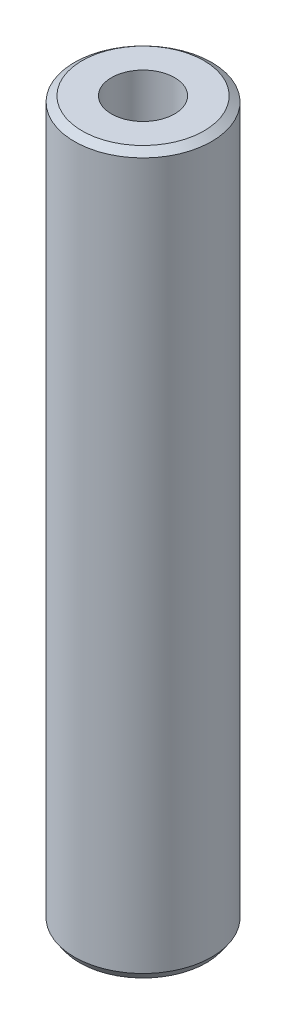
ISO-10303-21;
HEADER;
FILE_DESCRIPTION(('STEP AP214'),'2;1');
FILE_NAME('part.step','',(''),(''),'','','');
FILE_SCHEMA(('AUTOMOTIVE_DESIGN { 1 0 10303 214 1 1 1 1 }'));
ENDSEC;
DATA;
#1=APPLICATION_CONTEXT('core data for automotive mechanical design processes');
#2=APPLICATION_PROTOCOL_DEFINITION('international standard','automotive_design',2000,#1);
#3=PRODUCT_CONTEXT('',#1,'mechanical');
#4=PRODUCT('Part','Part','',(#3));
#5=PRODUCT_RELATED_PRODUCT_CATEGORY('part','',(#4));
#6=PRODUCT_DEFINITION_FORMATION('','',#4);
#7=PRODUCT_DEFINITION_CONTEXT('part definition',#1,'design');
#8=PRODUCT_DEFINITION('design','',#6,#7);
#9=PRODUCT_DEFINITION_SHAPE('','',#8);
#10=(LENGTH_UNIT() NAMED_UNIT(*) SI_UNIT(.MILLI.,.METRE.));
#11=(NAMED_UNIT(*) PLANE_ANGLE_UNIT() SI_UNIT($,.RADIAN.));
#12=(NAMED_UNIT(*) SI_UNIT($,.STERADIAN.) SOLID_ANGLE_UNIT());
#13=UNCERTAINTY_MEASURE_WITH_UNIT(LENGTH_MEASURE(1.E-05),#10,'distance_accuracy_value','');
#14=(GEOMETRIC_REPRESENTATION_CONTEXT(3) GLOBAL_UNCERTAINTY_ASSIGNED_CONTEXT((#13)) GLOBAL_UNIT_ASSIGNED_CONTEXT((#10,
#11,#12)) REPRESENTATION_CONTEXT('',''));
#15=CARTESIAN_POINT('',(0.,0.,0.));
#16=DIRECTION('',(0.,0.,1.));
#17=DIRECTION('',(1.,0.,0.));
#18=AXIS2_PLACEMENT_3D('',#15,#16,#17);
#19=CARTESIAN_POINT('',(0.,419.466632299774,0.));
#20=DIRECTION('',(0.,-1.,0.));
#21=DIRECTION('',(0.,0.,-1.));
#22=AXIS2_PLACEMENT_3D('',#19,#20,#21);
#23=CYLINDRICAL_SURFACE('',#22,40.);
#24=CARTESIAN_POINT('',(0.,416.352013566591,0.));
#25=DIRECTION('',(0.,1.,0.));
#26=DIRECTION('',(0.,0.,1.));
#27=AXIS2_PLACEMENT_3D('',#24,#25,#26);
#28=CIRCLE('',#27,40.);
#29=CARTESIAN_POINT('',(0.,416.352013566591,-40.));
#30=VERTEX_POINT('',#29);
#31=EDGE_CURVE('E50',#30,#30,#28,.F.);
#32=ORIENTED_EDGE('',*,*,#31,.T.);
#33=EDGE_LOOP('',(#32));
#34=FACE_BOUND('',#33,.T.);
#35=CARTESIAN_POINT('',(0.,4.47765466066197,0.));
#36=DIRECTION('',(0.,1.,0.));
#37=DIRECTION('',(0.,0.,1.));
#38=AXIS2_PLACEMENT_3D('',#35,#36,#37);
#39=CIRCLE('',#38,40.);
#40=CARTESIAN_POINT('',(0.,4.47765466066197,40.));
#41=VERTEX_POINT('',#40);
#42=EDGE_CURVE('E51',#41,#41,#39,.T.);
#43=ORIENTED_EDGE('',*,*,#42,.T.);
#44=EDGE_LOOP('',(#43));
#45=FACE_BOUND('',#44,.T.);
#46=ADVANCED_FACE('F39',(#34,#45),#23,.T.);
#47=CARTESIAN_POINT('',(0.,419.466632299774,0.));
#48=DIRECTION('',(0.,1.,0.));
#49=DIRECTION('',(0.,0.,1.));
#50=AXIS2_PLACEMENT_3D('',#47,#48,#49);
#51=PLANE('',#50);
#52=CARTESIAN_POINT('',(0.,419.466632299774,0.));
#53=DIRECTION('',(0.,1.,0.));
#54=DIRECTION('',(0.,0.,1.));
#55=AXIS2_PLACEMENT_3D('',#52,#53,#54);
#56=CIRCLE('',#55,35.5223453393382);
#57=CARTESIAN_POINT('',(0.,419.466632299774,-35.5223453393382));
#58=VERTEX_POINT('',#57);
#59=EDGE_CURVE('E54',#58,#58,#56,.T.);
#60=ORIENTED_EDGE('',*,*,#59,.T.);
#61=EDGE_LOOP('',(#60));
#62=FACE_BOUND('',#61,.T.);
#63=CARTESIAN_POINT('',(0.,419.466632299774,0.));
#64=DIRECTION('',(0.,1.,0.));
#65=DIRECTION('',(0.,0.,1.));
#66=AXIS2_PLACEMENT_3D('',#63,#64,#65);
#67=CIRCLE('',#66,18.3951845976825);
#68=CARTESIAN_POINT('',(0.,419.466632299774,18.3951845976825));
#69=VERTEX_POINT('',#68);
#70=EDGE_CURVE('E58',#69,#69,#67,.T.);
#71=ORIENTED_EDGE('',*,*,#70,.F.);
#72=EDGE_LOOP('',(#71));
#73=FACE_BOUND('',#72,.T.);
#74=ADVANCED_FACE('F69',(#62,#73),#51,.T.);
#75=CARTESIAN_POINT('',(0.,0.,0.));
#76=DIRECTION('',(0.,1.,0.));
#77=DIRECTION('',(0.,0.,1.));
#78=AXIS2_PLACEMENT_3D('',#75,#76,#77);
#79=PLANE('',#78);
#80=CARTESIAN_POINT('',(0.,0.,0.));
#81=DIRECTION('',(0.,1.,0.));
#82=DIRECTION('',(0.,0.,1.));
#83=AXIS2_PLACEMENT_3D('',#80,#81,#82);
#84=CIRCLE('',#83,36.8853812668172);
#85=CARTESIAN_POINT('',(0.,0.,36.8853812668172));
#86=VERTEX_POINT('',#85);
#87=EDGE_CURVE('E10',#86,#86,#84,.F.);
#88=ORIENTED_EDGE('',*,*,#87,.T.);
#89=EDGE_LOOP('',(#88));
#90=FACE_BOUND('',#89,.T.);
#91=CARTESIAN_POINT('',(0.,0.,0.));
#92=DIRECTION('',(0.,1.,0.));
#93=DIRECTION('',(0.,0.,1.));
#94=AXIS2_PLACEMENT_3D('',#91,#92,#93);
#95=CIRCLE('',#94,18.3951845976825);
#96=CARTESIAN_POINT('',(0.,0.,18.3951845976825));
#97=VERTEX_POINT('',#96);
#98=EDGE_CURVE('E63',#97,#97,#95,.T.);
#99=ORIENTED_EDGE('',*,*,#98,.T.);
#100=EDGE_LOOP('',(#99));
#101=FACE_BOUND('',#100,.T.);
#102=ADVANCED_FACE('F75',(#90,#101),#79,.F.);
#103=CARTESIAN_POINT('',(0.,419.466632299774,0.));
#104=DIRECTION('',(0.,-1.,0.));
#105=DIRECTION('',(0.,0.,-1.));
#106=AXIS2_PLACEMENT_3D('',#103,#104,#105);
#107=CYLINDRICAL_SURFACE('',#106,18.3951845976825);
#108=ORIENTED_EDGE('',*,*,#70,.T.);
#109=EDGE_LOOP('',(#108));
#110=FACE_BOUND('',#109,.T.);
#111=ORIENTED_EDGE('',*,*,#98,.F.);
#112=EDGE_LOOP('',(#111));
#113=FACE_BOUND('',#112,.T.);
#114=ADVANCED_FACE('F70',(#110,#113),#107,.F.);
#115=CARTESIAN_POINT('',(0.,419.466632299774,0.));
#116=DIRECTION('',(0.,-1.,0.));
#117=DIRECTION('',(0.,0.,-1.));
#118=AXIS2_PLACEMENT_3D('',#115,#116,#117);
#119=CONICAL_SURFACE('',#118,35.5223453393382,0.963035187304045);
#120=CARTESIAN_POINT('',(0.,416.352013566591,-40.));
#121=CARTESIAN_POINT('',(0.,416.384457511729,-39.9533577639515));
#122=CARTESIAN_POINT('',(0.,416.416901456866,-39.9067155279029));
#123=CARTESIAN_POINT('',(0.,416.481789347141,-39.8134310558058));
#124=CARTESIAN_POINT('',(0.,416.514233292278,-39.7667888197572));
#125=CARTESIAN_POINT('',(0.,416.579121182553,-39.6735043476601));
#126=CARTESIAN_POINT('',(0.,416.61156512769,-39.6268621116116));
#127=CARTESIAN_POINT('',(0.,416.676453017965,-39.5335776395144));
#128=CARTESIAN_POINT('',(0.,416.708896963102,-39.4869354034659));
#129=CARTESIAN_POINT('',(0.,416.773784853377,-39.3936509313687));
#130=CARTESIAN_POINT('',(0.,416.806228798514,-39.3470086953202));
#131=CARTESIAN_POINT('',(0.,416.871116688789,-39.2537242232231));
#132=CARTESIAN_POINT('',(0.,416.903560633926,-39.2070819871745));
#133=CARTESIAN_POINT('',(0.,416.968448524201,-39.1137975150774));
#134=CARTESIAN_POINT('',(0.,417.000892469338,-39.0671552790288));
#135=CARTESIAN_POINT('',(0.,417.065780359613,-38.9738708069317));
#136=CARTESIAN_POINT('',(0.,417.09822430475,-38.9272285708831));
#137=CARTESIAN_POINT('',(0.,417.163112195024,-38.833944098786));
#138=CARTESIAN_POINT('',(0.,417.195556140162,-38.7873018627375));
#139=CARTESIAN_POINT('',(0.,417.260444030436,-38.6940173906403));
#140=CARTESIAN_POINT('',(0.,417.292887975574,-38.6473751545918));
#141=CARTESIAN_POINT('',(0.,417.357775865848,-38.5540906824947));
#142=CARTESIAN_POINT('',(0.,417.390219810986,-38.5074484464461));
#143=CARTESIAN_POINT('',(0.,417.45510770126,-38.414163974349));
#144=CARTESIAN_POINT('',(0.,417.487551646398,-38.3675217383004));
#145=CARTESIAN_POINT('',(0.,417.552439536672,-38.2742372662033));
#146=CARTESIAN_POINT('',(0.,417.58488348181,-38.2275950301547));
#147=CARTESIAN_POINT('',(0.,417.649771372084,-38.1343105580576));
#148=CARTESIAN_POINT('',(0.,417.682215317222,-38.0876683220091));
#149=CARTESIAN_POINT('',(0.,417.747103207496,-37.9943838499119));
#150=CARTESIAN_POINT('',(0.,417.779547152634,-37.9477416138634));
#151=CARTESIAN_POINT('',(0.,417.844435042908,-37.8544571417663));
#152=CARTESIAN_POINT('',(0.,417.876878988046,-37.8078149057177));
#153=CARTESIAN_POINT('',(0.,417.94176687832,-37.7145304336206));
#154=CARTESIAN_POINT('',(0.,417.974210823457,-37.667888197572));
#155=CARTESIAN_POINT('',(0.,418.039098713732,-37.5746037254749));
#156=CARTESIAN_POINT('',(0.,418.071542658869,-37.5279614894263));
#157=CARTESIAN_POINT('',(0.,418.136430549144,-37.4346770173292));
#158=CARTESIAN_POINT('',(0.,418.168874494281,-37.3880347812806));
#159=CARTESIAN_POINT('',(0.,418.233762384556,-37.2947503091835));
#160=CARTESIAN_POINT('',(0.,418.266206329693,-37.248108073135));
#161=CARTESIAN_POINT('',(0.,418.331094219968,-37.1548236010378));
#162=CARTESIAN_POINT('',(0.,418.363538165105,-37.1081813649893));
#163=CARTESIAN_POINT('',(0.,418.42842605538,-37.0148968928922));
#164=CARTESIAN_POINT('',(0.,418.460870000517,-36.9682546568436));
#165=CARTESIAN_POINT('',(0.,418.525757890792,-36.8749701847465));
#166=CARTESIAN_POINT('',(0.,418.558201835929,-36.8283279486979));
#167=CARTESIAN_POINT('',(0.,418.623089726204,-36.7350434766008));
#168=CARTESIAN_POINT('',(0.,418.655533671341,-36.6884012405522));
#169=CARTESIAN_POINT('',(0.,418.720421561616,-36.5951167684551));
#170=CARTESIAN_POINT('',(0.,418.752865506753,-36.5484745324066));
#171=CARTESIAN_POINT('',(0.,418.817753397028,-36.4551900603094));
#172=CARTESIAN_POINT('',(0.,418.850197342165,-36.4085478242609));
#173=CARTESIAN_POINT('',(0.,418.91508523244,-36.3152633521637));
#174=CARTESIAN_POINT('',(0.,418.947529177577,-36.2686211161152));
#175=CARTESIAN_POINT('',(0.,419.012417067852,-36.1753366440181));
#176=CARTESIAN_POINT('',(0.,419.044861012989,-36.1286944079695));
#177=CARTESIAN_POINT('',(0.,419.109748903264,-36.0354099358724));
#178=CARTESIAN_POINT('',(0.,419.142192848401,-35.9887676998238));
#179=CARTESIAN_POINT('',(0.,419.207080738676,-35.8954832277267));
#180=CARTESIAN_POINT('',(0.,419.239524683813,-35.8488409916781));
#181=CARTESIAN_POINT('',(0.,419.304412574088,-35.755556519581));
#182=CARTESIAN_POINT('',(0.,419.336856519225,-35.7089142835325));
#183=CARTESIAN_POINT('',(0.,419.401744409499,-35.6156298114353));
#184=CARTESIAN_POINT('',(0.,419.434188354637,-35.5689875753868));
#185=CARTESIAN_POINT('',(0.,419.466632299774,-35.5223453393382));
#186=B_SPLINE_CURVE_WITH_KNOTS('',3,(#120,#121,#122,#123,#124,#125,#126,#127,#128,#129,#130,
#131,#132,#133,#134,#135,#136,#137,#138,#139,#140,#141,#142,#143,#144,#145,#146,#147,#148,#149,
#150,#151,#152,#153,#154,#155,#156,#157,#158,#159,#160,#161,#162,#163,#164,#165,#166,#167,#168,
#169,#170,#171,#172,#173,#174,#175,#176,#177,#178,#179,#180,#181,#182,#183,#184,#185),
.UNSPECIFIED.,.F.,.F.,(4,2,2,2,2,2,2,2,2,2,2,2,2,2,2,2,2,2,2,2,2,2,2,2,2,2,2,2,2,2,2,2,4),(0.,
0.170449317502726,0.340898635005446,0.511347952508199,0.681797270010925,0.852246587513645,
1.0226959050164,1.19314522251912,1.36359454002184,1.5340438575246,1.70449317502732,
1.87494249253004,2.04539181003279,2.21584112753552,2.38629044503824,2.55673976254099,
2.72718908004372,2.89763839754644,3.06808771504919,3.23853703255192,3.40898635005464,
3.57943566755739,3.74988498506011,3.92033430256284,4.09078362006559,4.26123293756831,
4.43168225507103,4.60213157257379,4.77258089007651,4.94303020757923,5.11347952508199,
5.28392884258471,5.45437816008747),.UNSPECIFIED.);
#187=EDGE_CURVE('BSEAM81',#30,#58,#186,.T.);
#188=ORIENTED_EDGE('',*,*,#31,.F.);
#189=ORIENTED_EDGE('',*,*,#59,.F.);
#190=ORIENTED_EDGE('',*,*,#187,.T.);
#191=ORIENTED_EDGE('',*,*,#187,.F.);
#192=EDGE_LOOP('',(#188,#190,#189,#191));
#193=FACE_BOUND('',#192,.T.);
#194=ADVANCED_FACE('F81',(#193),#119,.T.);
#195=CARTESIAN_POINT('',(0.,4.47765466066197,0.));
#196=DIRECTION('',(0.,1.,0.));
#197=DIRECTION('',(0.,0.,1.));
#198=AXIS2_PLACEMENT_3D('',#195,#196,#197);
#199=CONICAL_SURFACE('',#198,40.,0.607761139490848);
#200=ORIENTED_EDGE('',*,*,#87,.F.);
#201=EDGE_LOOP('',(#200));
#202=FACE_BOUND('',#201,.T.);
#203=ORIENTED_EDGE('',*,*,#42,.F.);
#204=EDGE_LOOP('',(#203));
#205=FACE_BOUND('',#204,.T.);
#206=ADVANCED_FACE('F45',(#202,#205),#199,.T.);
#207=CLOSED_SHELL('',(#46,#74,#102,#114,#194,#206));
#208=MANIFOLD_SOLID_BREP('B2',#207);
#209=ADVANCED_BREP_SHAPE_REPRESENTATION('',(#18,#208),#14);
#210=SHAPE_DEFINITION_REPRESENTATION(#9,#209);
ENDSEC;
END-ISO-10303-21;
